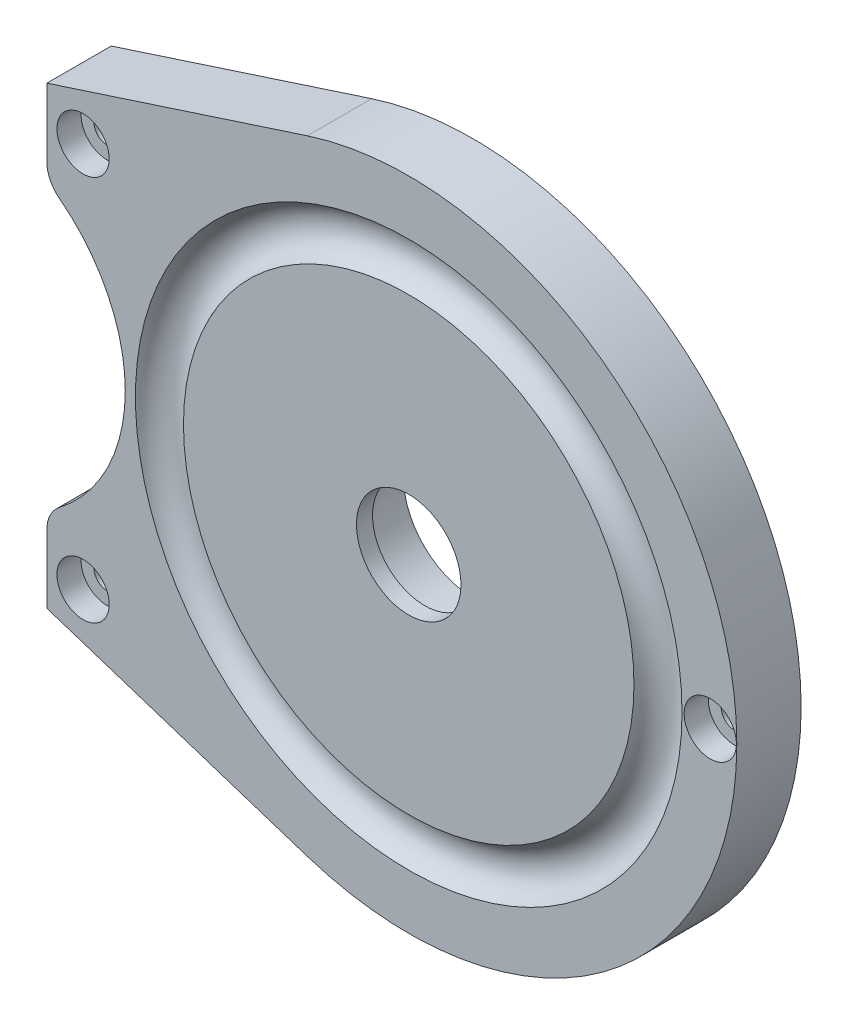
ISO-10303-21;
HEADER;
FILE_DESCRIPTION(('STEP AP214'),'2;1');
FILE_NAME('part.step','',(''),(''),'','','');
FILE_SCHEMA(('AUTOMOTIVE_DESIGN { 1 0 10303 214 1 1 1 1 }'));
ENDSEC;
DATA;
#1=APPLICATION_CONTEXT('core data for automotive mechanical design processes');
#2=APPLICATION_PROTOCOL_DEFINITION('international standard','automotive_design',2000,#1);
#3=PRODUCT_CONTEXT('',#1,'mechanical');
#4=PRODUCT('Part','Part','',(#3));
#5=PRODUCT_RELATED_PRODUCT_CATEGORY('part','',(#4));
#6=PRODUCT_DEFINITION_FORMATION('','',#4);
#7=PRODUCT_DEFINITION_CONTEXT('part definition',#1,'design');
#8=PRODUCT_DEFINITION('design','',#6,#7);
#9=PRODUCT_DEFINITION_SHAPE('','',#8);
#10=(LENGTH_UNIT() NAMED_UNIT(*) SI_UNIT(.MILLI.,.METRE.));
#11=(NAMED_UNIT(*) PLANE_ANGLE_UNIT() SI_UNIT($,.RADIAN.));
#12=(NAMED_UNIT(*) SI_UNIT($,.STERADIAN.) SOLID_ANGLE_UNIT());
#13=UNCERTAINTY_MEASURE_WITH_UNIT(LENGTH_MEASURE(1.E-05),#10,'distance_accuracy_value','');
#14=(GEOMETRIC_REPRESENTATION_CONTEXT(3) GLOBAL_UNCERTAINTY_ASSIGNED_CONTEXT((#13)) GLOBAL_UNIT_ASSIGNED_CONTEXT((#10,
#11,#12)) REPRESENTATION_CONTEXT('',''));
#15=CARTESIAN_POINT('',(0.,0.,0.));
#16=DIRECTION('',(0.,0.,1.));
#17=DIRECTION('',(1.,0.,0.));
#18=AXIS2_PLACEMENT_3D('',#15,#16,#17);
#19=CARTESIAN_POINT('',(37.5,0.,-111.172582231032));
#20=DIRECTION('',(0.,0.,1.));
#21=DIRECTION('',(1.,0.,0.));
#22=AXIS2_PLACEMENT_3D('',#19,#20,#21);
#23=CYLINDRICAL_SURFACE('',#22,3.25);
#24=CARTESIAN_POINT('',(37.5,0.,5.));
#25=DIRECTION('',(0.,0.,1.));
#26=DIRECTION('',(1.,0.,0.));
#27=AXIS2_PLACEMENT_3D('',#24,#25,#26);
#28=CIRCLE('',#27,3.25);
#29=CARTESIAN_POINT('',(40.75,0.,5.));
#30=VERTEX_POINT('',#29);
#31=EDGE_CURVE('E11',#30,#30,#28,.T.);
#32=ORIENTED_EDGE('',*,*,#31,.F.);
#33=EDGE_LOOP('',(#32));
#34=FACE_BOUND('',#33,.T.);
#35=CARTESIAN_POINT('',(37.5,0.,8.));
#36=DIRECTION('',(0.,0.,1.));
#37=DIRECTION('',(1.,0.,0.));
#38=AXIS2_PLACEMENT_3D('',#35,#36,#37);
#39=CIRCLE('',#38,3.25);
#40=CARTESIAN_POINT('',(40.75,0.,8.));
#41=VERTEX_POINT('',#40);
#42=EDGE_CURVE('E179',#41,#41,#39,.T.);
#43=ORIENTED_EDGE('',*,*,#42,.T.);
#44=EDGE_LOOP('',(#43));
#45=FACE_BOUND('',#44,.T.);
#46=ADVANCED_FACE('F16',(#34,#45),#23,.F.);
#47=CARTESIAN_POINT('',(37.5,1.625,5.));
#48=DIRECTION('',(0.,0.,1.));
#49=DIRECTION('',(1.,0.,0.));
#50=AXIS2_PLACEMENT_3D('',#47,#48,#49);
#51=PLANE('',#50);
#52=CARTESIAN_POINT('',(37.5,0.,5.));
#53=DIRECTION('',(0.,0.,1.));
#54=DIRECTION('',(1.,0.,0.));
#55=AXIS2_PLACEMENT_3D('',#52,#53,#54);
#56=CIRCLE('',#55,1.65);
#57=CARTESIAN_POINT('',(39.15,0.,5.));
#58=VERTEX_POINT('',#57);
#59=EDGE_CURVE('E27',#58,#58,#56,.T.);
#60=ORIENTED_EDGE('',*,*,#59,.F.);
#61=EDGE_LOOP('',(#60));
#62=FACE_BOUND('',#61,.T.);
#63=ORIENTED_EDGE('',*,*,#31,.T.);
#64=EDGE_LOOP('',(#63));
#65=FACE_BOUND('',#64,.T.);
#66=ADVANCED_FACE('F342',(#62,#65),#51,.T.);
#67=CARTESIAN_POINT('',(37.5,0.,-111.172582231032));
#68=DIRECTION('',(0.,0.,1.));
#69=DIRECTION('',(1.,0.,0.));
#70=AXIS2_PLACEMENT_3D('',#67,#68,#69);
#71=CYLINDRICAL_SURFACE('',#70,1.65);
#72=CARTESIAN_POINT('',(37.5,0.,0.));
#73=DIRECTION('',(0.,0.,-1.));
#74=DIRECTION('',(1.,0.,0.));
#75=AXIS2_PLACEMENT_3D('',#72,#73,#74);
#76=CIRCLE('',#75,1.65);
#77=CARTESIAN_POINT('',(39.15,0.,0.));
#78=VERTEX_POINT('',#77);
#79=EDGE_CURVE('E189',#78,#78,#76,.T.);
#80=ORIENTED_EDGE('',*,*,#79,.T.);
#81=EDGE_LOOP('',(#80));
#82=FACE_BOUND('',#81,.T.);
#83=ORIENTED_EDGE('',*,*,#59,.T.);
#84=EDGE_LOOP('',(#83));
#85=FACE_BOUND('',#84,.T.);
#86=ADVANCED_FACE('F338',(#82,#85),#71,.F.);
#87=CARTESIAN_POINT('',(-40.5,-24.,-111.172582231032));
#88=DIRECTION('',(0.,0.,1.));
#89=DIRECTION('',(1.,0.,0.));
#90=AXIS2_PLACEMENT_3D('',#87,#88,#89);
#91=CYLINDRICAL_SURFACE('',#90,3.25);
#92=CARTESIAN_POINT('',(-40.5,-24.,5.));
#93=DIRECTION('',(0.,0.,1.));
#94=DIRECTION('',(1.,0.,0.));
#95=AXIS2_PLACEMENT_3D('',#92,#93,#94);
#96=CIRCLE('',#95,3.25);
#97=CARTESIAN_POINT('',(-37.25,-24.,5.));
#98=VERTEX_POINT('',#97);
#99=EDGE_CURVE('E241',#98,#98,#96,.T.);
#100=ORIENTED_EDGE('',*,*,#99,.F.);
#101=EDGE_LOOP('',(#100));
#102=FACE_BOUND('',#101,.T.);
#103=CARTESIAN_POINT('',(-40.5,-24.,8.));
#104=DIRECTION('',(0.,0.,1.));
#105=DIRECTION('',(1.,0.,0.));
#106=AXIS2_PLACEMENT_3D('',#103,#104,#105);
#107=CIRCLE('',#106,3.25);
#108=CARTESIAN_POINT('',(-37.25,-24.,8.));
#109=VERTEX_POINT('',#108);
#110=EDGE_CURVE('E169',#109,#109,#107,.T.);
#111=ORIENTED_EDGE('',*,*,#110,.T.);
#112=EDGE_LOOP('',(#111));
#113=FACE_BOUND('',#112,.T.);
#114=ADVANCED_FACE('F341',(#102,#113),#91,.F.);
#115=CARTESIAN_POINT('',(-40.5,-22.375,5.));
#116=DIRECTION('',(0.,0.,1.));
#117=DIRECTION('',(1.,0.,0.));
#118=AXIS2_PLACEMENT_3D('',#115,#116,#117);
#119=PLANE('',#118);
#120=CARTESIAN_POINT('',(-40.5,-24.,5.));
#121=DIRECTION('',(0.,0.,1.));
#122=DIRECTION('',(1.,0.,0.));
#123=AXIS2_PLACEMENT_3D('',#120,#121,#122);
#124=CIRCLE('',#123,1.65);
#125=CARTESIAN_POINT('',(-38.85,-24.,5.));
#126=VERTEX_POINT('',#125);
#127=EDGE_CURVE('E245',#126,#126,#124,.T.);
#128=ORIENTED_EDGE('',*,*,#127,.F.);
#129=EDGE_LOOP('',(#128));
#130=FACE_BOUND('',#129,.T.);
#131=ORIENTED_EDGE('',*,*,#99,.T.);
#132=EDGE_LOOP('',(#131));
#133=FACE_BOUND('',#132,.T.);
#134=ADVANCED_FACE('F365',(#130,#133),#119,.T.);
#135=CARTESIAN_POINT('',(-40.5,-24.,-111.172582231032));
#136=DIRECTION('',(0.,0.,1.));
#137=DIRECTION('',(1.,0.,0.));
#138=AXIS2_PLACEMENT_3D('',#135,#136,#137);
#139=CYLINDRICAL_SURFACE('',#138,1.65);
#140=CARTESIAN_POINT('',(-40.5,-24.,0.));
#141=DIRECTION('',(0.,0.,-1.));
#142=DIRECTION('',(1.,0.,0.));
#143=AXIS2_PLACEMENT_3D('',#140,#141,#142);
#144=CIRCLE('',#143,1.65);
#145=CARTESIAN_POINT('',(-38.85,-24.,0.));
#146=VERTEX_POINT('',#145);
#147=EDGE_CURVE('E193',#146,#146,#144,.T.);
#148=ORIENTED_EDGE('',*,*,#147,.T.);
#149=EDGE_LOOP('',(#148));
#150=FACE_BOUND('',#149,.T.);
#151=ORIENTED_EDGE('',*,*,#127,.T.);
#152=EDGE_LOOP('',(#151));
#153=FACE_BOUND('',#152,.T.);
#154=ADVANCED_FACE('F362',(#150,#153),#139,.F.);
#155=CARTESIAN_POINT('',(-40.5,24.,-111.172582231032));
#156=DIRECTION('',(0.,0.,1.));
#157=DIRECTION('',(1.,0.,0.));
#158=AXIS2_PLACEMENT_3D('',#155,#156,#157);
#159=CYLINDRICAL_SURFACE('',#158,3.25);
#160=CARTESIAN_POINT('',(-40.5,24.,5.));
#161=DIRECTION('',(0.,0.,1.));
#162=DIRECTION('',(1.,0.,0.));
#163=AXIS2_PLACEMENT_3D('',#160,#161,#162);
#164=CIRCLE('',#163,3.25);
#165=CARTESIAN_POINT('',(-37.25,24.,5.));
#166=VERTEX_POINT('',#165);
#167=EDGE_CURVE('E233',#166,#166,#164,.T.);
#168=ORIENTED_EDGE('',*,*,#167,.F.);
#169=EDGE_LOOP('',(#168));
#170=FACE_BOUND('',#169,.T.);
#171=CARTESIAN_POINT('',(-40.5,24.,8.));
#172=DIRECTION('',(0.,0.,1.));
#173=DIRECTION('',(1.,0.,0.));
#174=AXIS2_PLACEMENT_3D('',#171,#172,#173);
#175=CIRCLE('',#174,3.25);
#176=CARTESIAN_POINT('',(-37.25,24.,8.));
#177=VERTEX_POINT('',#176);
#178=EDGE_CURVE('E164',#177,#177,#175,.T.);
#179=ORIENTED_EDGE('',*,*,#178,.T.);
#180=EDGE_LOOP('',(#179));
#181=FACE_BOUND('',#180,.T.);
#182=ADVANCED_FACE('F165',(#170,#181),#159,.F.);
#183=CARTESIAN_POINT('',(-40.5,25.625,5.));
#184=DIRECTION('',(0.,0.,1.));
#185=DIRECTION('',(1.,0.,0.));
#186=AXIS2_PLACEMENT_3D('',#183,#184,#185);
#187=PLANE('',#186);
#188=CARTESIAN_POINT('',(-40.5,24.,5.));
#189=DIRECTION('',(0.,0.,1.));
#190=DIRECTION('',(1.,0.,0.));
#191=AXIS2_PLACEMENT_3D('',#188,#189,#190);
#192=CIRCLE('',#191,1.65);
#193=CARTESIAN_POINT('',(-38.85,24.,5.));
#194=VERTEX_POINT('',#193);
#195=EDGE_CURVE('E201',#194,#194,#192,.T.);
#196=ORIENTED_EDGE('',*,*,#195,.F.);
#197=EDGE_LOOP('',(#196));
#198=FACE_BOUND('',#197,.T.);
#199=ORIENTED_EDGE('',*,*,#167,.T.);
#200=EDGE_LOOP('',(#199));
#201=FACE_BOUND('',#200,.T.);
#202=ADVANCED_FACE('F357',(#198,#201),#187,.T.);
#203=CARTESIAN_POINT('',(-40.5,24.,-111.172582231032));
#204=DIRECTION('',(0.,0.,1.));
#205=DIRECTION('',(1.,0.,0.));
#206=AXIS2_PLACEMENT_3D('',#203,#204,#205);
#207=CYLINDRICAL_SURFACE('',#206,1.65);
#208=CARTESIAN_POINT('',(-40.5,24.,0.));
#209=DIRECTION('',(0.,0.,-1.));
#210=DIRECTION('',(1.,0.,0.));
#211=AXIS2_PLACEMENT_3D('',#208,#209,#210);
#212=CIRCLE('',#211,1.65);
#213=CARTESIAN_POINT('',(-38.85,24.,0.));
#214=VERTEX_POINT('',#213);
#215=EDGE_CURVE('E208',#214,#214,#212,.T.);
#216=ORIENTED_EDGE('',*,*,#215,.T.);
#217=EDGE_LOOP('',(#216));
#218=FACE_BOUND('',#217,.T.);
#219=ORIENTED_EDGE('',*,*,#195,.T.);
#220=EDGE_LOOP('',(#219));
#221=FACE_BOUND('',#220,.T.);
#222=ADVANCED_FACE('F360',(#218,#221),#207,.F.);
#223=CARTESIAN_POINT('',(-41.,19.8100353356576,-135.740172545647));
#224=DIRECTION('',(0.,0.,1.));
#225=DIRECTION('',(1.,0.,0.));
#226=AXIS2_PLACEMENT_3D('',#223,#224,#225);
#227=CYLINDRICAL_SURFACE('',#226,4.);
#228=CARTESIAN_POINT('',(-41.,19.8100353356576,8.));
#229=DIRECTION('',(0.,0.,1.));
#230=DIRECTION('',(1.,0.,0.));
#231=AXIS2_PLACEMENT_3D('',#228,#229,#230);
#232=CIRCLE('',#231,4.);
#233=CARTESIAN_POINT('',(-45.,19.8100353356576,7.99999999998136));
#234=VERTEX_POINT('',#233);
#235=CARTESIAN_POINT('',(-43.44,16.6404296819524,8.));
#236=VERTEX_POINT('',#235);
#237=EDGE_CURVE('E230',#234,#236,#232,.T.);
#238=ORIENTED_EDGE('',*,*,#237,.F.);
#239=DIRECTION('',(0.,0.,1.));
#240=VECTOR('',#239,1.);
#241=CARTESIAN_POINT('',(-45.,19.8100353356576,7.99999999998136));
#242=LINE('',#241,#240);
#243=CARTESIAN_POINT('',(-45.,19.8100353356576,0.));
#244=VERTEX_POINT('',#243);
#245=EDGE_CURVE('E194',#244,#234,#242,.T.);
#246=ORIENTED_EDGE('',*,*,#245,.F.);
#247=CARTESIAN_POINT('',(-41.,19.8100353356576,0.));
#248=DIRECTION('',(0.,0.,-1.));
#249=DIRECTION('',(1.,0.,0.));
#250=AXIS2_PLACEMENT_3D('',#247,#248,#249);
#251=CIRCLE('',#250,4.);
#252=CARTESIAN_POINT('',(-43.44,16.6404296819524,0.));
#253=VERTEX_POINT('',#252);
#254=EDGE_CURVE('E275',#253,#244,#251,.T.);
#255=ORIENTED_EDGE('',*,*,#254,.F.);
#256=DIRECTION('',(0.,0.,-1.));
#257=VECTOR('',#256,1.);
#258=CARTESIAN_POINT('',(-43.44,16.6404296819524,-135.740172545647));
#259=LINE('',#258,#257);
#260=EDGE_CURVE('E199',#236,#253,#259,.T.);
#261=ORIENTED_EDGE('',*,*,#260,.F.);
#262=EDGE_LOOP('',(#238,#246,#255,#261));
#263=FACE_BOUND('',#262,.T.);
#264=ADVANCED_FACE('F369',(#263),#227,.T.);
#265=CARTESIAN_POINT('',(-41.,-19.8100353356576,-135.740172545647));
#266=DIRECTION('',(0.,0.,1.));
#267=DIRECTION('',(1.,0.,0.));
#268=AXIS2_PLACEMENT_3D('',#265,#266,#267);
#269=CYLINDRICAL_SURFACE('',#268,4.);
#270=CARTESIAN_POINT('',(-41.,-19.8100353356576,0.));
#271=DIRECTION('',(0.,0.,-1.));
#272=DIRECTION('',(1.,0.,0.));
#273=AXIS2_PLACEMENT_3D('',#270,#271,#272);
#274=CIRCLE('',#273,4.);
#275=CARTESIAN_POINT('',(-45.,-19.8100353356576,0.));
#276=VERTEX_POINT('',#275);
#277=CARTESIAN_POINT('',(-43.44,-16.6404296819524,0.));
#278=VERTEX_POINT('',#277);
#279=EDGE_CURVE('E203',#276,#278,#274,.T.);
#280=ORIENTED_EDGE('',*,*,#279,.F.);
#281=DIRECTION('',(0.,0.,-1.));
#282=VECTOR('',#281,1.);
#283=CARTESIAN_POINT('',(-45.,-19.8100353356576,0.));
#284=LINE('',#283,#282);
#285=CARTESIAN_POINT('',(-45.,-19.8100353356576,7.99999999998136));
#286=VERTEX_POINT('',#285);
#287=EDGE_CURVE('E209',#286,#276,#284,.T.);
#288=ORIENTED_EDGE('',*,*,#287,.F.);
#289=CARTESIAN_POINT('',(-41.,-19.8100353356576,8.));
#290=DIRECTION('',(0.,0.,1.));
#291=DIRECTION('',(1.,0.,0.));
#292=AXIS2_PLACEMENT_3D('',#289,#290,#291);
#293=CIRCLE('',#292,4.);
#294=CARTESIAN_POINT('',(-43.44,-16.6404296819524,8.));
#295=VERTEX_POINT('',#294);
#296=EDGE_CURVE('E177',#295,#286,#293,.T.);
#297=ORIENTED_EDGE('',*,*,#296,.F.);
#298=DIRECTION('',(0.,0.,1.));
#299=VECTOR('',#298,1.);
#300=CARTESIAN_POINT('',(-43.44,-16.6404296819524,-135.740172545647));
#301=LINE('',#300,#299);
#302=EDGE_CURVE('E197',#278,#295,#301,.T.);
#303=ORIENTED_EDGE('',*,*,#302,.F.);
#304=EDGE_LOOP('',(#280,#288,#297,#303));
#305=FACE_BOUND('',#304,.T.);
#306=ADVANCED_FACE('F298',(#305),#269,.T.);
#307=CARTESIAN_POINT('',(-56.25,0.,-135.740172545647));
#308=DIRECTION('',(0.,0.,1.));
#309=DIRECTION('',(1.,0.,0.));
#310=AXIS2_PLACEMENT_3D('',#307,#308,#309);
#311=CYLINDRICAL_SURFACE('',#310,21.);
#312=CARTESIAN_POINT('',(-56.25,0.,0.));
#313=DIRECTION('',(0.,0.,1.));
#314=DIRECTION('',(1.,0.,0.));
#315=AXIS2_PLACEMENT_3D('',#312,#313,#314);
#316=CIRCLE('',#315,21.);
#317=EDGE_CURVE('E207',#278,#253,#316,.T.);
#318=ORIENTED_EDGE('',*,*,#317,.F.);
#319=ORIENTED_EDGE('',*,*,#302,.T.);
#320=CARTESIAN_POINT('',(-56.25,0.,8.));
#321=DIRECTION('',(0.,0.,1.));
#322=DIRECTION('',(1.,0.,0.));
#323=AXIS2_PLACEMENT_3D('',#320,#321,#322);
#324=CIRCLE('',#323,21.);
#325=EDGE_CURVE('E168',#295,#236,#324,.T.);
#326=ORIENTED_EDGE('',*,*,#325,.T.);
#327=ORIENTED_EDGE('',*,*,#260,.T.);
#328=EDGE_LOOP('',(#318,#319,#326,#327));
#329=FACE_BOUND('',#328,.T.);
#330=ADVANCED_FACE('F323',(#329),#311,.F.);
#331=CARTESIAN_POINT('',(-42.2534459459062,-29.1706819273839,500000.));
#332=DIRECTION('',(0.309016994374948,0.951056516295153,0.));
#333=DIRECTION('',(0.,0.,-1.));
#334=AXIS2_PLACEMENT_3D('',#331,#332,#333);
#335=PLANE('',#334);
#336=DIRECTION('',(0.951056516295154,-0.309016994374948,0.));
#337=VECTOR('',#336,1.);
#338=CARTESIAN_POINT('',(-42.2534459459062,-29.1706819273839,7.99999999998136));
#339=LINE('',#338,#337);
#340=CARTESIAN_POINT('',(-45.,-28.2782724184405,8.00000000009504));
#341=VERTEX_POINT('',#340);
#342=CARTESIAN_POINT('',(-12.6078933704979,-38.8031058648423,8.00000000009504));
#343=VERTEX_POINT('',#342);
#344=EDGE_CURVE('E256',#341,#343,#339,.T.);
#345=ORIENTED_EDGE('',*,*,#344,.F.);
#346=DIRECTION('',(0.,0.,-1.));
#347=VECTOR('',#346,1.);
#348=CARTESIAN_POINT('',(-45.,-28.2782724184405,500000.));
#349=LINE('',#348,#347);
#350=CARTESIAN_POINT('',(-45.,-28.2782724184405,0.));
#351=VERTEX_POINT('',#350);
#352=EDGE_CURVE('E226',#341,#351,#349,.T.);
#353=ORIENTED_EDGE('',*,*,#352,.T.);
#354=DIRECTION('',(0.951056516295154,-0.309016994374948,0.));
#355=VECTOR('',#354,1.);
#356=CARTESIAN_POINT('',(-42.2534459459062,-29.1706819273839,0.));
#357=LINE('',#356,#355);
#358=CARTESIAN_POINT('',(-12.6078933704979,-38.8031058648423,0.));
#359=VERTEX_POINT('',#358);
#360=EDGE_CURVE('E308',#351,#359,#357,.T.);
#361=ORIENTED_EDGE('',*,*,#360,.T.);
#362=DIRECTION('',(0.,0.,-1.));
#363=VECTOR('',#362,1.);
#364=CARTESIAN_POINT('',(-12.6078933704979,-38.8031058648423,500000.));
#365=LINE('',#364,#363);
#366=EDGE_CURVE('E190',#343,#359,#365,.T.);
#367=ORIENTED_EDGE('',*,*,#366,.F.);
#368=EDGE_LOOP('',(#345,#353,#361,#367));
#369=FACE_BOUND('',#368,.T.);
#370=ADVANCED_FACE('F305',(#369),#335,.F.);
#371=CARTESIAN_POINT('',(-45.,19.3832738118439,500000.));
#372=DIRECTION('',(-1.,0.,0.));
#373=DIRECTION('',(0.,0.,1.));
#374=AXIS2_PLACEMENT_3D('',#371,#372,#373);
#375=PLANE('',#374);
#376=DIRECTION('',(0.,1.,0.));
#377=VECTOR('',#376,1.);
#378=CARTESIAN_POINT('',(-45.,19.3832738118439,0.));
#379=LINE('',#378,#377);
#380=CARTESIAN_POINT('',(-45.,28.2782724184405,0.));
#381=VERTEX_POINT('',#380);
#382=EDGE_CURVE('E270',#244,#381,#379,.T.);
#383=ORIENTED_EDGE('',*,*,#382,.F.);
#384=ORIENTED_EDGE('',*,*,#245,.T.);
#385=DIRECTION('',(0.,1.,0.));
#386=VECTOR('',#385,1.);
#387=CARTESIAN_POINT('',(-45.,19.3832738118439,7.99999999998136));
#388=LINE('',#387,#386);
#389=CARTESIAN_POINT('',(-45.,28.2782724184405,8.00000000009504));
#390=VERTEX_POINT('',#389);
#391=EDGE_CURVE('E240',#234,#390,#388,.T.);
#392=ORIENTED_EDGE('',*,*,#391,.T.);
#393=DIRECTION('',(0.,0.,-1.));
#394=VECTOR('',#393,1.);
#395=CARTESIAN_POINT('',(-45.,28.2782724184405,500000.));
#396=LINE('',#395,#394);
#397=EDGE_CURVE('E198',#390,#381,#396,.T.);
#398=ORIENTED_EDGE('',*,*,#397,.T.);
#399=EDGE_LOOP('',(#383,#384,#392,#398));
#400=FACE_BOUND('',#399,.T.);
#401=ADVANCED_FACE('F378',(#400),#375,.T.);
#402=CARTESIAN_POINT('',(-42.2534459459062,29.1706819273839,500000.));
#403=DIRECTION('',(-0.309016994374948,0.951056516295153,0.));
#404=DIRECTION('',(0.,0.,1.));
#405=AXIS2_PLACEMENT_3D('',#402,#403,#404);
#406=PLANE('',#405);
#407=ORIENTED_EDGE('',*,*,#397,.F.);
#408=DIRECTION('',(0.951056516295154,0.309016994374948,0.));
#409=VECTOR('',#408,1.);
#410=CARTESIAN_POINT('',(-42.2534459459062,29.1706819273839,7.99999999998136));
#411=LINE('',#410,#409);
#412=CARTESIAN_POINT('',(-12.6078933704979,38.8031058648423,8.00000000009504));
#413=VERTEX_POINT('',#412);
#414=EDGE_CURVE('E253',#390,#413,#411,.T.);
#415=ORIENTED_EDGE('',*,*,#414,.T.);
#416=DIRECTION('',(0.,0.,-1.));
#417=VECTOR('',#416,1.);
#418=CARTESIAN_POINT('',(-12.6078933704979,38.8031058648423,500000.));
#419=LINE('',#418,#417);
#420=CARTESIAN_POINT('',(-12.6078933704979,38.8031058648423,0.));
#421=VERTEX_POINT('',#420);
#422=EDGE_CURVE('E222',#413,#421,#419,.T.);
#423=ORIENTED_EDGE('',*,*,#422,.T.);
#424=DIRECTION('',(0.951056516295154,0.309016994374948,0.));
#425=VECTOR('',#424,1.);
#426=CARTESIAN_POINT('',(-42.2534459459062,29.1706819273839,0.));
#427=LINE('',#426,#425);
#428=EDGE_CURVE('E274',#381,#421,#427,.T.);
#429=ORIENTED_EDGE('',*,*,#428,.F.);
#430=EDGE_LOOP('',(#407,#415,#423,#429));
#431=FACE_BOUND('',#430,.T.);
#432=ADVANCED_FACE('F18',(#431),#406,.T.);
#433=CARTESIAN_POINT('',(0.,0.,9.));
#434=DIRECTION('',(0.,0.,1.));
#435=DIRECTION('',(1.,0.,0.));
#436=AXIS2_PLACEMENT_3D('',#433,#434,#435);
#437=TOROIDAL_SURFACE('',#436,31.,3.15);
#438=CARTESIAN_POINT('',(0.,0.,8.));
#439=DIRECTION('',(0.,0.,1.));
#440=DIRECTION('',(-1.,0.,0.));
#441=AXIS2_PLACEMENT_3D('',#438,#439,#440);
#442=CIRCLE('',#441,28.0129445937513);
#443=CARTESIAN_POINT('',(-28.0129445937513,0.,8.));
#444=VERTEX_POINT('',#443);
#445=EDGE_CURVE('E156',#444,#444,#442,.T.);
#446=ORIENTED_EDGE('',*,*,#445,.F.);
#447=EDGE_LOOP('',(#446));
#448=FACE_BOUND('',#447,.T.);
#449=CARTESIAN_POINT('',(0.,0.,8.));
#450=DIRECTION('',(0.,0.,-1.));
#451=DIRECTION('',(1.,0.,0.));
#452=AXIS2_PLACEMENT_3D('',#449,#450,#451);
#453=CIRCLE('',#452,33.9870554062488);
#454=CARTESIAN_POINT('',(33.9870554062488,0.,8.));
#455=VERTEX_POINT('',#454);
#456=EDGE_CURVE('E227',#455,#455,#453,.T.);
#457=ORIENTED_EDGE('',*,*,#456,.F.);
#458=EDGE_LOOP('',(#457));
#459=FACE_BOUND('',#458,.T.);
#460=ADVANCED_FACE('F370',(#448,#459),#437,.F.);
#461=CARTESIAN_POINT('',(0.,0.,10.7360328796205));
#462=DIRECTION('',(0.,0.,1.));
#463=DIRECTION('',(1.,0.,0.));
#464=AXIS2_PLACEMENT_3D('',#461,#462,#463);
#465=CYLINDRICAL_SURFACE('',#464,6.5);
#466=CARTESIAN_POINT('',(0.,0.,8.));
#467=DIRECTION('',(0.,0.,1.));
#468=DIRECTION('',(1.,0.,0.));
#469=AXIS2_PLACEMENT_3D('',#466,#467,#468);
#470=CIRCLE('',#469,6.5);
#471=CARTESIAN_POINT('',(6.5,0.,8.));
#472=VERTEX_POINT('',#471);
#473=EDGE_CURVE('E20',#472,#472,#470,.T.);
#474=ORIENTED_EDGE('',*,*,#473,.T.);
#475=EDGE_LOOP('',(#474));
#476=FACE_BOUND('',#475,.T.);
#477=CARTESIAN_POINT('',(0.,0.,6.));
#478=DIRECTION('',(0.,0.,1.));
#479=DIRECTION('',(1.,0.,0.));
#480=AXIS2_PLACEMENT_3D('',#477,#478,#479);
#481=CIRCLE('',#480,6.5);
#482=CARTESIAN_POINT('',(6.5,0.,6.));
#483=VERTEX_POINT('',#482);
#484=EDGE_CURVE('E217',#483,#483,#481,.T.);
#485=ORIENTED_EDGE('',*,*,#484,.F.);
#486=EDGE_LOOP('',(#485));
#487=FACE_BOUND('',#486,.T.);
#488=ADVANCED_FACE('F373',(#476,#487),#465,.F.);
#489=CARTESIAN_POINT('',(0.,8.86528678300724,6.));
#490=DIRECTION('',(0.,0.,1.));
#491=DIRECTION('',(1.,0.,0.));
#492=AXIS2_PLACEMENT_3D('',#489,#490,#491);
#493=PLANE('',#492);
#494=ORIENTED_EDGE('',*,*,#484,.T.);
#495=EDGE_LOOP('',(#494));
#496=FACE_BOUND('',#495,.T.);
#497=CARTESIAN_POINT('',(0.,0.,6.));
#498=DIRECTION('',(0.,0.,1.));
#499=DIRECTION('',(1.,0.,0.));
#500=AXIS2_PLACEMENT_3D('',#497,#498,#499);
#501=CIRCLE('',#500,8.65);
#502=CARTESIAN_POINT('',(8.65,0.,6.));
#503=VERTEX_POINT('',#502);
#504=EDGE_CURVE('E147',#503,#503,#501,.T.);
#505=ORIENTED_EDGE('',*,*,#504,.F.);
#506=EDGE_LOOP('',(#505));
#507=FACE_BOUND('',#506,.T.);
#508=ADVANCED_FACE('F398',(#496,#507),#493,.F.);
#509=CARTESIAN_POINT('',(0.,0.,10.7360328796205));
#510=DIRECTION('',(0.,0.,1.));
#511=DIRECTION('',(1.,0.,0.));
#512=AXIS2_PLACEMENT_3D('',#509,#510,#511);
#513=CYLINDRICAL_SURFACE('',#512,8.65);
#514=ORIENTED_EDGE('',*,*,#504,.T.);
#515=EDGE_LOOP('',(#514));
#516=FACE_BOUND('',#515,.T.);
#517=CARTESIAN_POINT('',(0.,0.,0.));
#518=DIRECTION('',(0.,0.,1.));
#519=DIRECTION('',(1.,0.,0.));
#520=AXIS2_PLACEMENT_3D('',#517,#518,#519);
#521=CIRCLE('',#520,8.65);
#522=CARTESIAN_POINT('',(8.65,0.,0.));
#523=VERTEX_POINT('',#522);
#524=EDGE_CURVE('E183',#523,#523,#521,.T.);
#525=ORIENTED_EDGE('',*,*,#524,.F.);
#526=EDGE_LOOP('',(#525));
#527=FACE_BOUND('',#526,.T.);
#528=ADVANCED_FACE('F401',(#516,#527),#513,.F.);
#529=CARTESIAN_POINT('',(0.,0.,8.));
#530=DIRECTION('',(0.,0.,1.));
#531=DIRECTION('',(1.,0.,0.));
#532=AXIS2_PLACEMENT_3D('',#529,#530,#531);
#533=PLANE('',#532);
#534=ORIENTED_EDGE('',*,*,#445,.T.);
#535=EDGE_LOOP('',(#534));
#536=FACE_BOUND('',#535,.T.);
#537=ORIENTED_EDGE('',*,*,#473,.F.);
#538=EDGE_LOOP('',(#537));
#539=FACE_BOUND('',#538,.T.);
#540=ADVANCED_FACE('F387',(#536,#539),#533,.T.);
#541=CARTESIAN_POINT('',(0.,0.,8.));
#542=DIRECTION('',(0.,0.,1.));
#543=DIRECTION('',(1.,0.,0.));
#544=AXIS2_PLACEMENT_3D('',#541,#542,#543);
#545=PLANE('',#544);
#546=ORIENTED_EDGE('',*,*,#456,.T.);
#547=EDGE_LOOP('',(#546));
#548=FACE_BOUND('',#547,.T.);
#549=ORIENTED_EDGE('',*,*,#325,.F.);
#550=ORIENTED_EDGE('',*,*,#296,.T.);
#551=DIRECTION('',(0.,1.,0.));
#552=VECTOR('',#551,1.);
#553=CARTESIAN_POINT('',(-45.,19.3832738118439,7.99999999998136));
#554=LINE('',#553,#552);
#555=EDGE_CURVE('E214',#341,#286,#554,.T.);
#556=ORIENTED_EDGE('',*,*,#555,.F.);
#557=ORIENTED_EDGE('',*,*,#344,.T.);
#558=CARTESIAN_POINT('',(0.,0.,8.));
#559=DIRECTION('',(0.,0.,1.));
#560=DIRECTION('',(1.,0.,0.));
#561=AXIS2_PLACEMENT_3D('',#558,#559,#560);
#562=CIRCLE('',#561,40.8);
#563=EDGE_CURVE('E221',#343,#413,#562,.T.);
#564=ORIENTED_EDGE('',*,*,#563,.T.);
#565=ORIENTED_EDGE('',*,*,#414,.F.);
#566=ORIENTED_EDGE('',*,*,#391,.F.);
#567=ORIENTED_EDGE('',*,*,#237,.T.);
#568=EDGE_LOOP('',(#549,#550,#556,#557,#564,#565,#566,#567));
#569=FACE_BOUND('',#568,.T.);
#570=ORIENTED_EDGE('',*,*,#178,.F.);
#571=EDGE_LOOP('',(#570));
#572=FACE_BOUND('',#571,.T.);
#573=ORIENTED_EDGE('',*,*,#110,.F.);
#574=EDGE_LOOP('',(#573));
#575=FACE_BOUND('',#574,.T.);
#576=ORIENTED_EDGE('',*,*,#42,.F.);
#577=EDGE_LOOP('',(#576));
#578=FACE_BOUND('',#577,.T.);
#579=ADVANCED_FACE('F295',(#548,#569,#572,#575,#578),#545,.T.);
#580=CARTESIAN_POINT('',(0.,0.,0.));
#581=DIRECTION('',(0.,0.,1.));
#582=DIRECTION('',(1.,0.,0.));
#583=AXIS2_PLACEMENT_3D('',#580,#581,#582);
#584=PLANE('',#583);
#585=ORIENTED_EDGE('',*,*,#524,.T.);
#586=EDGE_LOOP('',(#585));
#587=FACE_BOUND('',#586,.T.);
#588=DIRECTION('',(0.,1.,0.));
#589=VECTOR('',#588,1.);
#590=CARTESIAN_POINT('',(-45.,19.3832738118439,0.));
#591=LINE('',#590,#589);
#592=EDGE_CURVE('E213',#351,#276,#591,.T.);
#593=ORIENTED_EDGE('',*,*,#592,.T.);
#594=ORIENTED_EDGE('',*,*,#279,.T.);
#595=ORIENTED_EDGE('',*,*,#317,.T.);
#596=ORIENTED_EDGE('',*,*,#254,.T.);
#597=ORIENTED_EDGE('',*,*,#382,.T.);
#598=ORIENTED_EDGE('',*,*,#428,.T.);
#599=CARTESIAN_POINT('',(0.,0.,0.));
#600=DIRECTION('',(0.,0.,1.));
#601=DIRECTION('',(1.,0.,0.));
#602=AXIS2_PLACEMENT_3D('',#599,#600,#601);
#603=CIRCLE('',#602,40.8);
#604=EDGE_CURVE('E185',#359,#421,#603,.T.);
#605=ORIENTED_EDGE('',*,*,#604,.F.);
#606=ORIENTED_EDGE('',*,*,#360,.F.);
#607=EDGE_LOOP('',(#593,#594,#595,#596,#597,#598,#605,#606));
#608=FACE_BOUND('',#607,.T.);
#609=ORIENTED_EDGE('',*,*,#215,.F.);
#610=EDGE_LOOP('',(#609));
#611=FACE_BOUND('',#610,.T.);
#612=ORIENTED_EDGE('',*,*,#147,.F.);
#613=EDGE_LOOP('',(#612));
#614=FACE_BOUND('',#613,.T.);
#615=ORIENTED_EDGE('',*,*,#79,.F.);
#616=EDGE_LOOP('',(#615));
#617=FACE_BOUND('',#616,.T.);
#618=ADVANCED_FACE('F326',(#587,#608,#611,#614,#617),#584,.F.);
#619=CARTESIAN_POINT('',(0.,0.,8.));
#620=DIRECTION('',(0.,0.,-1.));
#621=DIRECTION('',(-1.,0.,0.));
#622=AXIS2_PLACEMENT_3D('',#619,#620,#621);
#623=CYLINDRICAL_SURFACE('',#622,40.8);
#624=ORIENTED_EDGE('',*,*,#422,.F.);
#625=ORIENTED_EDGE('',*,*,#563,.F.);
#626=ORIENTED_EDGE('',*,*,#366,.T.);
#627=ORIENTED_EDGE('',*,*,#604,.T.);
#628=EDGE_LOOP('',(#624,#625,#626,#627));
#629=FACE_BOUND('',#628,.T.);
#630=ADVANCED_FACE('F329',(#629),#623,.T.);
#631=CARTESIAN_POINT('',(-45.,19.3832738118439,500000.));
#632=DIRECTION('',(-1.,0.,0.));
#633=DIRECTION('',(0.,0.,1.));
#634=AXIS2_PLACEMENT_3D('',#631,#632,#633);
#635=PLANE('',#634);
#636=ORIENTED_EDGE('',*,*,#555,.T.);
#637=ORIENTED_EDGE('',*,*,#287,.T.);
#638=ORIENTED_EDGE('',*,*,#592,.F.);
#639=ORIENTED_EDGE('',*,*,#352,.F.);
#640=EDGE_LOOP('',(#636,#637,#638,#639));
#641=FACE_BOUND('',#640,.T.);
#642=ADVANCED_FACE('F302',(#641),#635,.T.);
#643=CLOSED_SHELL('',(#46,#66,#86,#114,#134,#154,#182,#202,#222,#264,#306,#330,#370,#401,#432,
#460,#488,#508,#528,#540,#579,#618,#630,#642));
#644=MANIFOLD_SOLID_BREP('B1',#643);
#645=ADVANCED_BREP_SHAPE_REPRESENTATION('',(#18,#644),#14);
#646=SHAPE_DEFINITION_REPRESENTATION(#9,#645);
ENDSEC;
END-ISO-10303-21;
